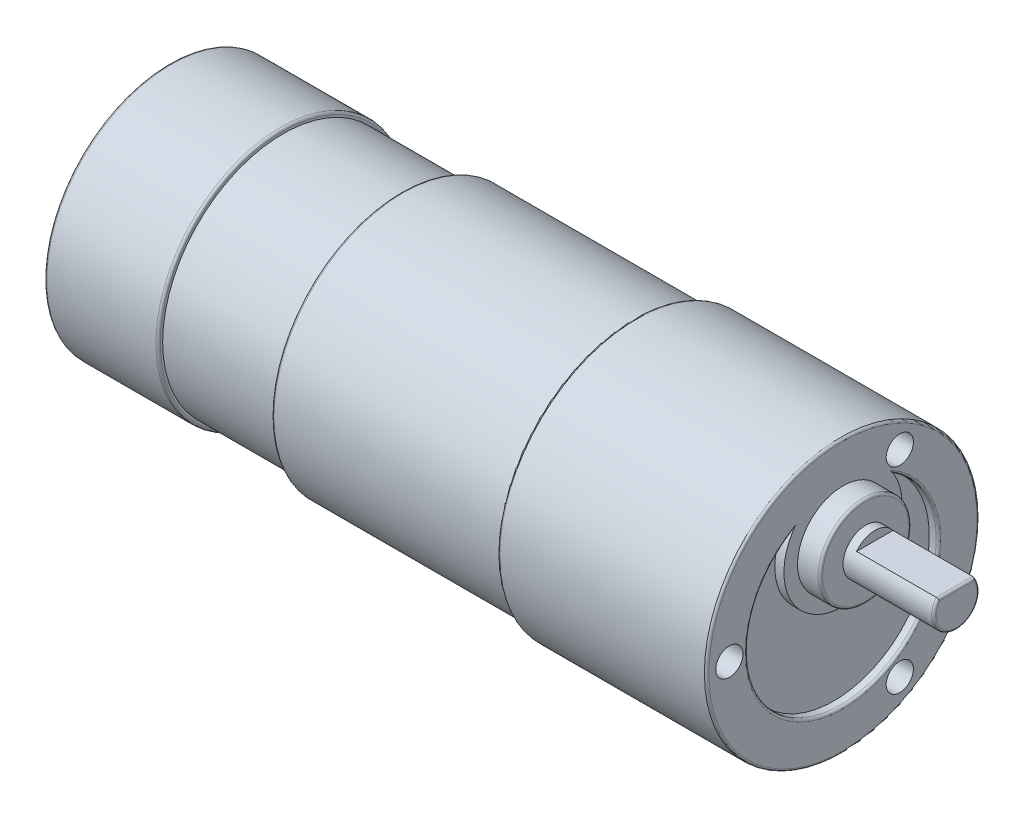
ISO-10303-21;
HEADER;
FILE_DESCRIPTION(('STEP AP214'),'2;1');
FILE_NAME('part.step','',(''),(''),'','','');
FILE_SCHEMA(('AUTOMOTIVE_DESIGN { 1 0 10303 214 1 1 1 1 }'));
ENDSEC;
DATA;
#1=APPLICATION_CONTEXT('core data for automotive mechanical design processes');
#2=APPLICATION_PROTOCOL_DEFINITION('international standard','automotive_design',2000,#1);
#3=PRODUCT_CONTEXT('',#1,'mechanical');
#4=PRODUCT('Part','Part','',(#3));
#5=PRODUCT_RELATED_PRODUCT_CATEGORY('part','',(#4));
#6=PRODUCT_DEFINITION_FORMATION('','',#4);
#7=PRODUCT_DEFINITION_CONTEXT('part definition',#1,'design');
#8=PRODUCT_DEFINITION('design','',#6,#7);
#9=PRODUCT_DEFINITION_SHAPE('','',#8);
#10=(LENGTH_UNIT() NAMED_UNIT(*) SI_UNIT(.MILLI.,.METRE.));
#11=(NAMED_UNIT(*) PLANE_ANGLE_UNIT() SI_UNIT($,.RADIAN.));
#12=(NAMED_UNIT(*) SI_UNIT($,.STERADIAN.) SOLID_ANGLE_UNIT());
#13=UNCERTAINTY_MEASURE_WITH_UNIT(LENGTH_MEASURE(1.E-05),#10,'distance_accuracy_value','');
#14=(GEOMETRIC_REPRESENTATION_CONTEXT(3) GLOBAL_UNCERTAINTY_ASSIGNED_CONTEXT((#13)) GLOBAL_UNIT_ASSIGNED_CONTEXT((#10,
#11,#12)) REPRESENTATION_CONTEXT('',''));
#15=CARTESIAN_POINT('',(0.,0.,0.));
#16=DIRECTION('',(0.,0.,1.));
#17=DIRECTION('',(1.,0.,0.));
#18=AXIS2_PLACEMENT_3D('',#15,#16,#17);
#19=CARTESIAN_POINT('',(74.1,0.,0.));
#20=DIRECTION('',(1.,0.,0.));
#21=DIRECTION('',(0.,0.,-1.));
#22=AXIS2_PLACEMENT_3D('',#19,#20,#21);
#23=PLANE('',#22);
#24=CARTESIAN_POINT('',(74.1,0.,0.));
#25=DIRECTION('',(1.,0.,0.));
#26=DIRECTION('',(0.,0.,-1.));
#27=AXIS2_PLACEMENT_3D('',#24,#25,#26);
#28=CIRCLE('',#27,14.75);
#29=CARTESIAN_POINT('',(74.1,0.,-14.75));
#30=VERTEX_POINT('',#29);
#31=EDGE_CURVE('E191',#30,#30,#28,.T.);
#32=ORIENTED_EDGE('',*,*,#31,.T.);
#33=EDGE_LOOP('',(#32));
#34=FACE_BOUND('',#33,.T.);
#35=CARTESIAN_POINT('',(74.1,0.,12.5));
#36=DIRECTION('',(1.,0.,0.));
#37=DIRECTION('',(0.,0.,-1.));
#38=AXIS2_PLACEMENT_3D('',#35,#36,#37);
#39=CIRCLE('',#38,1.5);
#40=CARTESIAN_POINT('',(74.1,0.,11.));
#41=VERTEX_POINT('',#40);
#42=EDGE_CURVE('E285',#41,#41,#39,.T.);
#43=ORIENTED_EDGE('',*,*,#42,.F.);
#44=EDGE_LOOP('',(#43));
#45=FACE_BOUND('',#44,.T.);
#46=CARTESIAN_POINT('',(74.1,-10.8253175473055,-6.24999999999998));
#47=DIRECTION('',(1.,0.,0.));
#48=DIRECTION('',(0.,0.,-1.));
#49=AXIS2_PLACEMENT_3D('',#46,#47,#48);
#50=CIRCLE('',#49,1.5);
#51=CARTESIAN_POINT('',(74.1,-10.8253175473055,-7.74999999999998));
#52=VERTEX_POINT('',#51);
#53=EDGE_CURVE('E294',#52,#52,#50,.T.);
#54=ORIENTED_EDGE('',*,*,#53,.F.);
#55=EDGE_LOOP('',(#54));
#56=FACE_BOUND('',#55,.T.);
#57=CARTESIAN_POINT('',(74.1,10.8253175473055,-6.24999999999997));
#58=DIRECTION('',(1.,0.,0.));
#59=DIRECTION('',(0.,0.,-1.));
#60=AXIS2_PLACEMENT_3D('',#57,#58,#59);
#61=CIRCLE('',#60,1.5);
#62=CARTESIAN_POINT('',(74.1,10.8253175473055,-7.74999999999997));
#63=VERTEX_POINT('',#62);
#64=EDGE_CURVE('E300',#63,#63,#61,.T.);
#65=ORIENTED_EDGE('',*,*,#64,.F.);
#66=EDGE_LOOP('',(#65));
#67=FACE_BOUND('',#66,.T.);
#68=CARTESIAN_POINT('',(74.1,5.5,0.));
#69=DIRECTION('',(1.,0.,0.));
#70=DIRECTION('',(0.,0.,-1.));
#71=AXIS2_PLACEMENT_3D('',#68,#69,#70);
#72=CIRCLE('',#71,5.);
#73=CARTESIAN_POINT('',(74.1,5.5,-5.));
#74=VERTEX_POINT('',#73);
#75=EDGE_CURVE('E115',#74,#74,#72,.T.);
#76=ORIENTED_EDGE('',*,*,#75,.F.);
#77=EDGE_LOOP('',(#76));
#78=FACE_BOUND('',#77,.T.);
#79=CARTESIAN_POINT('',(74.1,5.5,0.));
#80=DIRECTION('',(1.,0.,0.));
#81=DIRECTION('',(0.,0.,-1.));
#82=AXIS2_PLACEMENT_3D('',#79,#80,#81);
#83=CIRCLE('',#82,6.5);
#84=CARTESIAN_POINT('',(74.1,9.41477272727273,5.18888759695194));
#85=VERTEX_POINT('',#84);
#86=CARTESIAN_POINT('',(74.1,9.41477272727273,-5.18888759695194));
#87=VERTEX_POINT('',#86);
#88=EDGE_CURVE('E107',#85,#87,#83,.T.);
#89=ORIENTED_EDGE('',*,*,#88,.T.);
#90=CARTESIAN_POINT('',(74.1,0.,0.));
#91=DIRECTION('',(1.,0.,0.));
#92=DIRECTION('',(0.,0.,-1.));
#93=AXIS2_PLACEMENT_3D('',#90,#91,#92);
#94=CIRCLE('',#93,10.75);
#95=EDGE_CURVE('E188',#87,#85,#94,.F.);
#96=ORIENTED_EDGE('',*,*,#95,.T.);
#97=EDGE_LOOP('',(#89,#96));
#98=FACE_BOUND('',#97,.T.);
#99=ADVANCED_FACE('F36',(#34,#45,#56,#67,#78,#98),#23,.T.);
#100=CARTESIAN_POINT('',(76.6,0.,0.));
#101=DIRECTION('',(-1.,0.,0.));
#102=DIRECTION('',(0.,0.,1.));
#103=AXIS2_PLACEMENT_3D('',#100,#101,#102);
#104=CYLINDRICAL_SURFACE('',#103,15.);
#105=CARTESIAN_POINT('',(51.35,0.,0.));
#106=DIRECTION('',(-1.,0.,0.));
#107=DIRECTION('',(0.,0.,1.));
#108=AXIS2_PLACEMENT_3D('',#105,#106,#107);
#109=CIRCLE('',#108,15.);
#110=CARTESIAN_POINT('',(51.35,0.,15.));
#111=VERTEX_POINT('',#110);
#112=EDGE_CURVE('E182',#111,#111,#109,.F.);
#113=ORIENTED_EDGE('',*,*,#112,.T.);
#114=EDGE_LOOP('',(#113));
#115=FACE_BOUND('',#114,.T.);
#116=CARTESIAN_POINT('',(73.85,0.,0.));
#117=DIRECTION('',(1.,0.,0.));
#118=DIRECTION('',(0.,0.,-1.));
#119=AXIS2_PLACEMENT_3D('',#116,#117,#118);
#120=CIRCLE('',#119,15.);
#121=CARTESIAN_POINT('',(73.85,0.,-15.));
#122=VERTEX_POINT('',#121);
#123=EDGE_CURVE('E179',#122,#122,#120,.F.);
#124=ORIENTED_EDGE('',*,*,#123,.T.);
#125=EDGE_LOOP('',(#124));
#126=FACE_BOUND('',#125,.T.);
#127=ADVANCED_FACE('F218',(#115,#126),#104,.T.);
#128=CARTESIAN_POINT('',(-4.33,0.,0.));
#129=DIRECTION('',(-1.,0.,0.));
#130=DIRECTION('',(0.,0.,1.));
#131=AXIS2_PLACEMENT_3D('',#128,#129,#130);
#132=CYLINDRICAL_SURFACE('',#131,13.75);
#133=CARTESIAN_POINT('',(12.25,0.,0.));
#134=DIRECTION('',(1.,0.,0.));
#135=DIRECTION('',(0.,0.,-1.));
#136=AXIS2_PLACEMENT_3D('',#133,#134,#135);
#137=CIRCLE('',#136,13.75);
#138=CARTESIAN_POINT('',(12.25,0.,-13.75));
#139=VERTEX_POINT('',#138);
#140=EDGE_CURVE('E162',#139,#139,#137,.F.);
#141=ORIENTED_EDGE('',*,*,#140,.T.);
#142=EDGE_LOOP('',(#141));
#143=FACE_BOUND('',#142,.T.);
#144=CARTESIAN_POINT('',(0.25,0.,0.));
#145=DIRECTION('',(1.,0.,0.));
#146=DIRECTION('',(0.,0.,-1.));
#147=AXIS2_PLACEMENT_3D('',#144,#145,#146);
#148=CIRCLE('',#147,13.75);
#149=CARTESIAN_POINT('',(0.25,0.,-13.75));
#150=VERTEX_POINT('',#149);
#151=EDGE_CURVE('E159',#150,#150,#148,.T.);
#152=ORIENTED_EDGE('',*,*,#151,.T.);
#153=EDGE_LOOP('',(#152));
#154=FACE_BOUND('',#153,.T.);
#155=ADVANCED_FACE('F239',(#143,#154),#132,.T.);
#156=CARTESIAN_POINT('',(12.5,13.75,0.));
#157=DIRECTION('',(1.,0.,0.));
#158=DIRECTION('',(0.,0.,-1.));
#159=AXIS2_PLACEMENT_3D('',#156,#157,#158);
#160=PLANE('',#159);
#161=CARTESIAN_POINT('',(12.5,0.,0.));
#162=DIRECTION('',(1.,0.,0.));
#163=DIRECTION('',(0.,0.,-1.));
#164=AXIS2_PLACEMENT_3D('',#161,#162,#163);
#165=CIRCLE('',#164,13.5);
#166=CARTESIAN_POINT('',(12.5,0.,-13.5));
#167=VERTEX_POINT('',#166);
#168=EDGE_CURVE('E166',#167,#167,#165,.T.);
#169=ORIENTED_EDGE('',*,*,#168,.T.);
#170=EDGE_LOOP('',(#169));
#171=FACE_BOUND('',#170,.T.);
#172=CARTESIAN_POINT('',(12.5,0.,0.));
#173=DIRECTION('',(-1.,0.,0.));
#174=DIRECTION('',(0.,0.,1.));
#175=AXIS2_PLACEMENT_3D('',#172,#173,#174);
#176=CIRCLE('',#175,13.25);
#177=CARTESIAN_POINT('',(12.5,0.,13.25));
#178=VERTEX_POINT('',#177);
#179=EDGE_CURVE('E125',#178,#178,#176,.T.);
#180=ORIENTED_EDGE('',*,*,#179,.T.);
#181=EDGE_LOOP('',(#180));
#182=FACE_BOUND('',#181,.T.);
#183=ADVANCED_FACE('F235',(#171,#182),#160,.T.);
#184=CARTESIAN_POINT('',(-4.33,0.,0.));
#185=DIRECTION('',(-1.,0.,0.));
#186=DIRECTION('',(0.,0.,1.));
#187=AXIS2_PLACEMENT_3D('',#184,#185,#186);
#188=CYLINDRICAL_SURFACE('',#187,13.25);
#189=CARTESIAN_POINT('',(25.5,0.,0.));
#190=DIRECTION('',(-1.,0.,0.));
#191=DIRECTION('',(0.,0.,1.));
#192=AXIS2_PLACEMENT_3D('',#189,#190,#191);
#193=CIRCLE('',#192,13.25);
#194=CARTESIAN_POINT('',(25.5,0.,13.25));
#195=VERTEX_POINT('',#194);
#196=EDGE_CURVE('E122',#195,#195,#193,.T.);
#197=ORIENTED_EDGE('',*,*,#196,.T.);
#198=EDGE_LOOP('',(#197));
#199=FACE_BOUND('',#198,.T.);
#200=ORIENTED_EDGE('',*,*,#179,.F.);
#201=EDGE_LOOP('',(#200));
#202=FACE_BOUND('',#201,.T.);
#203=ADVANCED_FACE('F231',(#199,#202),#188,.T.);
#204=CARTESIAN_POINT('',(25.5,13.25,0.));
#205=DIRECTION('',(-1.,0.,0.));
#206=DIRECTION('',(0.,0.,1.));
#207=AXIS2_PLACEMENT_3D('',#204,#205,#206);
#208=PLANE('',#207);
#209=CARTESIAN_POINT('',(25.5,0.,0.));
#210=DIRECTION('',(-1.,0.,0.));
#211=DIRECTION('',(0.,0.,1.));
#212=AXIS2_PLACEMENT_3D('',#209,#210,#211);
#213=CIRCLE('',#212,14.);
#214=CARTESIAN_POINT('',(25.5,0.,14.));
#215=VERTEX_POINT('',#214);
#216=EDGE_CURVE('E170',#215,#215,#213,.T.);
#217=ORIENTED_EDGE('',*,*,#216,.T.);
#218=EDGE_LOOP('',(#217));
#219=FACE_BOUND('',#218,.T.);
#220=ORIENTED_EDGE('',*,*,#196,.F.);
#221=EDGE_LOOP('',(#220));
#222=FACE_BOUND('',#221,.T.);
#223=ADVANCED_FACE('F227',(#219,#222),#208,.T.);
#224=CARTESIAN_POINT('',(-4.33,0.,0.));
#225=DIRECTION('',(-1.,0.,0.));
#226=DIRECTION('',(0.,0.,1.));
#227=AXIS2_PLACEMENT_3D('',#224,#225,#226);
#228=CYLINDRICAL_SURFACE('',#227,14.25);
#229=CARTESIAN_POINT('',(25.75,0.,0.));
#230=DIRECTION('',(-1.,0.,0.));
#231=DIRECTION('',(0.,0.,1.));
#232=AXIS2_PLACEMENT_3D('',#229,#230,#231);
#233=CIRCLE('',#232,14.25);
#234=CARTESIAN_POINT('',(25.75,0.,14.25));
#235=VERTEX_POINT('',#234);
#236=EDGE_CURVE('E173',#235,#235,#233,.F.);
#237=ORIENTED_EDGE('',*,*,#236,.T.);
#238=EDGE_LOOP('',(#237));
#239=FACE_BOUND('',#238,.T.);
#240=CARTESIAN_POINT('',(51.1,0.,0.));
#241=DIRECTION('',(-1.,0.,0.));
#242=DIRECTION('',(0.,0.,1.));
#243=AXIS2_PLACEMENT_3D('',#240,#241,#242);
#244=CIRCLE('',#243,14.25);
#245=CARTESIAN_POINT('',(51.1,0.,14.25));
#246=VERTEX_POINT('',#245);
#247=EDGE_CURVE('E119',#246,#246,#244,.T.);
#248=ORIENTED_EDGE('',*,*,#247,.T.);
#249=EDGE_LOOP('',(#248));
#250=FACE_BOUND('',#249,.T.);
#251=ADVANCED_FACE('F223',(#239,#250),#228,.T.);
#252=CARTESIAN_POINT('',(51.1,14.25,0.));
#253=DIRECTION('',(-1.,0.,0.));
#254=DIRECTION('',(0.,0.,1.));
#255=AXIS2_PLACEMENT_3D('',#252,#253,#254);
#256=PLANE('',#255);
#257=CARTESIAN_POINT('',(51.1,0.,0.));
#258=DIRECTION('',(-1.,0.,0.));
#259=DIRECTION('',(0.,0.,1.));
#260=AXIS2_PLACEMENT_3D('',#257,#258,#259);
#261=CIRCLE('',#260,14.75);
#262=CARTESIAN_POINT('',(51.1,0.,14.75));
#263=VERTEX_POINT('',#262);
#264=EDGE_CURVE('E176',#263,#263,#261,.T.);
#265=ORIENTED_EDGE('',*,*,#264,.T.);
#266=EDGE_LOOP('',(#265));
#267=FACE_BOUND('',#266,.T.);
#268=ORIENTED_EDGE('',*,*,#247,.F.);
#269=EDGE_LOOP('',(#268));
#270=FACE_BOUND('',#269,.T.);
#271=ADVANCED_FACE('F220',(#267,#270),#256,.T.);
#272=CARTESIAN_POINT('',(0.,0.,0.));
#273=DIRECTION('',(1.,0.,0.));
#274=DIRECTION('',(0.,0.,-1.));
#275=AXIS2_PLACEMENT_3D('',#272,#273,#274);
#276=PLANE('',#275);
#277=CARTESIAN_POINT('',(0.,0.,0.));
#278=DIRECTION('',(1.,0.,0.));
#279=DIRECTION('',(0.,0.,-1.));
#280=AXIS2_PLACEMENT_3D('',#277,#278,#279);
#281=CIRCLE('',#280,13.5);
#282=CARTESIAN_POINT('',(0.,0.,-13.5));
#283=VERTEX_POINT('',#282);
#284=EDGE_CURVE('E185',#283,#283,#281,.F.);
#285=ORIENTED_EDGE('',*,*,#284,.T.);
#286=EDGE_LOOP('',(#285));
#287=FACE_BOUND('',#286,.T.);
#288=ADVANCED_FACE('F214',(#287),#276,.F.);
#289=CARTESIAN_POINT('',(74.1,5.5,0.));
#290=DIRECTION('',(1.,0.,0.));
#291=DIRECTION('',(0.,0.,-1.));
#292=AXIS2_PLACEMENT_3D('',#289,#290,#291);
#293=CYLINDRICAL_SURFACE('',#292,5.);
#294=CARTESIAN_POINT('',(76.35,5.5,0.));
#295=DIRECTION('',(1.,0.,0.));
#296=DIRECTION('',(0.,0.,-1.));
#297=AXIS2_PLACEMENT_3D('',#294,#295,#296);
#298=CIRCLE('',#297,5.);
#299=CARTESIAN_POINT('',(76.35,5.5,-5.));
#300=VERTEX_POINT('',#299);
#301=EDGE_CURVE('E156',#300,#300,#298,.F.);
#302=ORIENTED_EDGE('',*,*,#301,.T.);
#303=EDGE_LOOP('',(#302));
#304=FACE_BOUND('',#303,.T.);
#305=ORIENTED_EDGE('',*,*,#75,.T.);
#306=EDGE_LOOP('',(#305));
#307=FACE_BOUND('',#306,.T.);
#308=ADVANCED_FACE('F209',(#304,#307),#293,.T.);
#309=CARTESIAN_POINT('',(77.6,5.5,0.));
#310=DIRECTION('',(1.,0.,0.));
#311=DIRECTION('',(0.,0.,-1.));
#312=AXIS2_PLACEMENT_3D('',#309,#310,#311);
#313=PLANE('',#312);
#314=CARTESIAN_POINT('',(77.6,5.5,0.));
#315=DIRECTION('',(1.,0.,0.));
#316=DIRECTION('',(0.,0.,-1.));
#317=AXIS2_PLACEMENT_3D('',#314,#315,#316);
#318=CIRCLE('',#317,2.5);
#319=CARTESIAN_POINT('',(77.6,7.,-2.));
#320=VERTEX_POINT('',#319);
#321=CARTESIAN_POINT('',(77.6,7.,2.));
#322=VERTEX_POINT('',#321);
#323=EDGE_CURVE('E129',#320,#322,#318,.T.);
#324=ORIENTED_EDGE('',*,*,#323,.T.);
#325=DIRECTION('',(0.,0.,-1.));
#326=VECTOR('',#325,1.);
#327=CARTESIAN_POINT('',(77.6,7.,2.));
#328=LINE('',#327,#326);
#329=EDGE_CURVE('E131',#322,#320,#328,.T.);
#330=ORIENTED_EDGE('',*,*,#329,.T.);
#331=EDGE_LOOP('',(#324,#330));
#332=FACE_BOUND('',#331,.T.);
#333=ADVANCED_FACE('F213',(#332),#313,.T.);
#334=CARTESIAN_POINT('',(77.6,7.,2.));
#335=DIRECTION('',(0.,-1.,0.));
#336=DIRECTION('',(0.,0.,-1.));
#337=AXIS2_PLACEMENT_3D('',#334,#335,#336);
#338=PLANE('',#337);
#339=DIRECTION('',(1.,0.,0.));
#340=VECTOR('',#339,1.);
#341=CARTESIAN_POINT('',(77.6,7.,2.));
#342=LINE('',#341,#340);
#343=CARTESIAN_POINT('',(86.35,7.,2.));
#344=VERTEX_POINT('',#343);
#345=EDGE_CURVE('E134',#322,#344,#342,.T.);
#346=ORIENTED_EDGE('',*,*,#345,.T.);
#347=DIRECTION('',(0.,0.,-1.));
#348=VECTOR('',#347,1.);
#349=CARTESIAN_POINT('',(86.35,7.,-2.));
#350=LINE('',#349,#348);
#351=CARTESIAN_POINT('',(86.35,7.,-2.));
#352=VERTEX_POINT('',#351);
#353=EDGE_CURVE('E143',#344,#352,#350,.T.);
#354=ORIENTED_EDGE('',*,*,#353,.T.);
#355=DIRECTION('',(1.,0.,0.));
#356=VECTOR('',#355,1.);
#357=CARTESIAN_POINT('',(77.6,7.,-2.));
#358=LINE('',#357,#356);
#359=EDGE_CURVE('E135',#320,#352,#358,.T.);
#360=ORIENTED_EDGE('',*,*,#359,.F.);
#361=ORIENTED_EDGE('',*,*,#329,.F.);
#362=EDGE_LOOP('',(#346,#354,#360,#361));
#363=FACE_BOUND('',#362,.T.);
#364=ADVANCED_FACE('F246',(#363),#338,.F.);
#365=CARTESIAN_POINT('',(86.6,5.5,0.));
#366=DIRECTION('',(1.,0.,0.));
#367=DIRECTION('',(0.,0.,-1.));
#368=AXIS2_PLACEMENT_3D('',#365,#366,#367);
#369=PLANE('',#368);
#370=CARTESIAN_POINT('',(86.6,5.5,0.));
#371=DIRECTION('',(1.,0.,0.));
#372=DIRECTION('',(0.,0.,-1.));
#373=AXIS2_PLACEMENT_3D('',#370,#371,#372);
#374=CIRCLE('',#373,2.25);
#375=CARTESIAN_POINT('',(86.6,6.74999999999992,1.87082869338702));
#376=VERTEX_POINT('',#375);
#377=CARTESIAN_POINT('',(86.6,6.74999999999992,-1.87082869338702));
#378=VERTEX_POINT('',#377);
#379=EDGE_CURVE('E146',#376,#378,#374,.T.);
#380=ORIENTED_EDGE('',*,*,#379,.T.);
#381=DIRECTION('',(0.,0.,-1.));
#382=VECTOR('',#381,1.);
#383=CARTESIAN_POINT('',(86.6,6.75,2.));
#384=LINE('',#383,#382);
#385=EDGE_CURVE('E148',#378,#376,#384,.F.);
#386=ORIENTED_EDGE('',*,*,#385,.T.);
#387=EDGE_LOOP('',(#380,#386));
#388=FACE_BOUND('',#387,.T.);
#389=ADVANCED_FACE('F250',(#388),#369,.T.);
#390=CARTESIAN_POINT('',(86.6,5.5,0.));
#391=DIRECTION('',(-1.,0.,0.));
#392=DIRECTION('',(0.,0.,1.));
#393=AXIS2_PLACEMENT_3D('',#390,#391,#392);
#394=CYLINDRICAL_SURFACE('',#393,2.5);
#395=ORIENTED_EDGE('',*,*,#359,.T.);
#396=CARTESIAN_POINT('',(86.35,5.5,0.));
#397=DIRECTION('',(1.,0.,0.));
#398=DIRECTION('',(0.,0.,-1.));
#399=AXIS2_PLACEMENT_3D('',#396,#397,#398);
#400=CIRCLE('',#399,2.5);
#401=EDGE_CURVE('E151',#352,#344,#400,.F.);
#402=ORIENTED_EDGE('',*,*,#401,.T.);
#403=ORIENTED_EDGE('',*,*,#345,.F.);
#404=ORIENTED_EDGE('',*,*,#323,.F.);
#405=EDGE_LOOP('',(#395,#402,#403,#404));
#406=FACE_BOUND('',#405,.T.);
#407=CARTESIAN_POINT('',(76.6,5.5,0.));
#408=DIRECTION('',(1.,0.,0.));
#409=DIRECTION('',(0.,0.,-1.));
#410=AXIS2_PLACEMENT_3D('',#407,#408,#409);
#411=CIRCLE('',#410,2.5);
#412=CARTESIAN_POINT('',(76.6,5.5,-2.5));
#413=VERTEX_POINT('',#412);
#414=EDGE_CURVE('E138',#413,#413,#411,.T.);
#415=ORIENTED_EDGE('',*,*,#414,.T.);
#416=EDGE_LOOP('',(#415));
#417=FACE_BOUND('',#416,.T.);
#418=ADVANCED_FACE('F254',(#406,#417),#394,.T.);
#419=CARTESIAN_POINT('',(76.6,0.,0.));
#420=DIRECTION('',(1.,0.,0.));
#421=DIRECTION('',(0.,0.,-1.));
#422=AXIS2_PLACEMENT_3D('',#419,#420,#421);
#423=PLANE('',#422);
#424=CARTESIAN_POINT('',(76.6,5.5,0.));
#425=DIRECTION('',(1.,0.,0.));
#426=DIRECTION('',(0.,0.,-1.));
#427=AXIS2_PLACEMENT_3D('',#424,#425,#426);
#428=CIRCLE('',#427,4.75);
#429=CARTESIAN_POINT('',(76.6,5.5,-4.75));
#430=VERTEX_POINT('',#429);
#431=EDGE_CURVE('E153',#430,#430,#428,.T.);
#432=ORIENTED_EDGE('',*,*,#431,.T.);
#433=EDGE_LOOP('',(#432));
#434=FACE_BOUND('',#433,.T.);
#435=ORIENTED_EDGE('',*,*,#414,.F.);
#436=EDGE_LOOP('',(#435));
#437=FACE_BOUND('',#436,.T.);
#438=ADVANCED_FACE('F207',(#434,#437),#423,.T.);
#439=CARTESIAN_POINT('',(73.1,5.5,0.));
#440=DIRECTION('',(1.,0.,0.));
#441=DIRECTION('',(0.,0.,-1.));
#442=AXIS2_PLACEMENT_3D('',#439,#440,#441);
#443=CYLINDRICAL_SURFACE('',#442,6.5);
#444=ORIENTED_EDGE('',*,*,#88,.F.);
#445=CARTESIAN_POINT('',(74.1,9.41477272727273,5.18888759695194));
#446=CARTESIAN_POINT('',(74.0999831649846,9.39188239122904,5.20615884082959));
#447=CARTESIAN_POINT('',(74.0991753234182,9.36886658255452,5.22328398875272));
#448=CARTESIAN_POINT('',(74.0957931354124,9.3226129209461,5.25722854772138));
#449=CARTESIAN_POINT('',(74.0932123987342,9.29937456562936,5.27404662610108));
#450=CARTESIAN_POINT('',(74.0861164066224,9.25299622371637,5.3071487445332));
#451=CARTESIAN_POINT('',(74.0816115410013,9.2298563734107,5.3234351542232));
#452=CARTESIAN_POINT('',(74.0703431126138,9.18376488104019,5.35543275883427));
#453=CARTESIAN_POINT('',(74.0635833442933,9.16081298872184,5.37114487120059));
#454=CARTESIAN_POINT('',(74.0505738368938,9.12464922044669,5.39557066729247));
#455=CARTESIAN_POINT('',(74.0452363549753,9.11127527741722,5.40452991113922));
#456=CARTESIAN_POINT('',(74.0333522593504,9.08475501451608,5.42215693384593));
#457=CARTESIAN_POINT('',(74.0267996367027,9.07161019745475,5.43082299943601));
#458=CARTESIAN_POINT('',(74.0100937271802,9.04198319364183,5.4502068165354));
#459=CARTESIAN_POINT('',(73.9994491725242,9.02567126336535,5.46076813371098));
#460=CARTESIAN_POINT('',(73.9749067539139,8.99480513941149,5.48057142003858));
#461=CARTESIAN_POINT('',(73.9610379237557,8.9802369205262,5.4898240431316));
#462=CARTESIAN_POINT('',(73.9390596873975,8.96299069281043,5.50070244888107));
#463=CARTESIAN_POINT('',(73.9328544347275,8.95861949916991,5.50345109614572));
#464=CARTESIAN_POINT('',(73.919790137191,8.95061304835876,5.50847451220193));
#465=CARTESIAN_POINT('',(73.9129306928377,8.94697824515758,5.51074898870195));
#466=CARTESIAN_POINT('',(73.8984844869997,8.94066519711013,5.51469285374608));
#467=CARTESIAN_POINT('',(73.8908887089306,8.9380014115633,5.51635310089658));
#468=CARTESIAN_POINT('',(73.875230242602,8.93401862802945,5.51883337619474));
#469=CARTESIAN_POINT('',(73.8671696716696,8.93269397335876,5.5196569386938));
#470=CARTESIAN_POINT('',(73.8575477575341,8.93202684836659,5.52007171065));
#471=CARTESIAN_POINT('',(73.8560393566279,8.93194865450147,5.52012032670253));
#472=CARTESIAN_POINT('',(73.8530208395366,8.93184443409094,5.52018512365069));
#473=CARTESIAN_POINT('',(73.8515107246499,8.93181838046335,5.52020132138473));
#474=CARTESIAN_POINT('',(73.85,8.93181818181818,5.52020144260535));
#475=B_SPLINE_CURVE_WITH_KNOTS('',3,(#445,#446,#447,#448,#449,#450,#451,#452,#453,#454,#455,
#456,#457,#458,#459,#460,#461,#462,#463,#464,#465,#466,#467,#468,#469,#470,#471,#472,#473,#474),
.UNSPECIFIED.,.F.,.F.,(4,2,2,2,2,2,2,2,2,2,2,2,2,2,4),(0.,0.086033021068687,0.172377778646507,
0.258262076114619,0.34400257444526,0.394845140897501,0.445946176578029,0.512246641303248,
0.577971751342751,0.60213310887671,0.626309316363986,0.650832092329457,0.675250842150749,
0.679783842547829,0.684314487845205),.UNSPECIFIED.);
#476=CARTESIAN_POINT('',(73.85,8.93181818181818,5.52020144260535));
#477=VERTEX_POINT('',#476);
#478=EDGE_CURVE('E11',#85,#477,#475,.T.);
#479=ORIENTED_EDGE('',*,*,#478,.T.);
#480=DIRECTION('',(1.,0.,0.));
#481=VECTOR('',#480,1.);
#482=CARTESIAN_POINT('',(73.1,8.93181818181818,5.52020144260535));
#483=LINE('',#482,#481);
#484=CARTESIAN_POINT('',(73.1,8.93181818181818,5.52020144260535));
#485=VERTEX_POINT('',#484);
#486=EDGE_CURVE('E93',#485,#477,#483,.T.);
#487=ORIENTED_EDGE('',*,*,#486,.F.);
#488=CARTESIAN_POINT('',(73.1,5.5,0.));
#489=DIRECTION('',(1.,0.,0.));
#490=DIRECTION('',(0.,0.,-1.));
#491=AXIS2_PLACEMENT_3D('',#488,#489,#490);
#492=CIRCLE('',#491,6.5);
#493=CARTESIAN_POINT('',(73.1,8.93181818181818,-5.52020144260535));
#494=VERTEX_POINT('',#493);
#495=EDGE_CURVE('E97',#485,#494,#492,.T.);
#496=ORIENTED_EDGE('',*,*,#495,.T.);
#497=DIRECTION('',(1.,0.,0.));
#498=VECTOR('',#497,1.);
#499=CARTESIAN_POINT('',(73.1,8.93181818181818,-5.52020144260535));
#500=LINE('',#499,#498);
#501=CARTESIAN_POINT('',(73.85,8.93181818181818,-5.52020144260535));
#502=VERTEX_POINT('',#501);
#503=EDGE_CURVE('E101',#494,#502,#500,.T.);
#504=ORIENTED_EDGE('',*,*,#503,.T.);
#505=CARTESIAN_POINT('',(73.85,8.93181818181818,-5.52020144260535));
#506=CARTESIAN_POINT('',(73.8568371419132,8.93180281094858,-5.52021065025864));
#507=CARTESIAN_POINT('',(73.8636509768345,8.93235286954474,-5.51986905081773));
#508=CARTESIAN_POINT('',(73.876989340396,8.93444190697464,-5.51856967414837));
#509=CARTESIAN_POINT('',(73.8835162568305,8.93596972410108,-5.51761885142953));
#510=CARTESIAN_POINT('',(73.8977122879727,8.94034426729592,-5.51489246680858));
#511=CARTESIAN_POINT('',(73.9052822443313,8.94341873928312,-5.51297423179716));
#512=CARTESIAN_POINT('',(73.9197603296231,8.95056087529103,-5.50850684291174));
#513=CARTESIAN_POINT('',(73.9266652003571,8.95463311359151,-5.50595478249582));
#514=CARTESIAN_POINT('',(73.9436441527478,8.96608952093307,-5.4987536130998));
#515=CARTESIAN_POINT('',(73.9531990477944,8.97401453429378,-5.49375295379665));
#516=CARTESIAN_POINT('',(73.9708239918423,8.99092131612563,-5.48302565409446));
#517=CARTESIAN_POINT('',(73.9788911113355,8.99990511360151,-5.47729761810294));
#518=CARTESIAN_POINT('',(74.0009226539621,9.02736326340329,-5.4596857108105));
#519=CARTESIAN_POINT('',(74.0132029619165,9.04674096011591,-5.44712634608222));
#520=CARTESIAN_POINT('',(74.0346159086907,9.08660356892157,-5.42096437681789));
#521=CARTESIAN_POINT('',(74.043726376092,9.10709516473281,-5.40735520656361));
#522=CARTESIAN_POINT('',(74.0607250616321,9.15178411402678,-5.37729528535604));
#523=CARTESIAN_POINT('',(74.0682011480643,9.17606104847757,-5.36073235371579));
#524=CARTESIAN_POINT('',(74.0805871535669,9.22485399697535,-5.32694543446326));
#525=CARTESIAN_POINT('',(74.0854919304833,9.24937039097393,-5.30972019559369));
#526=CARTESIAN_POINT('',(74.0929885834177,9.29751029419979,-5.27539166677475));
#527=CARTESIAN_POINT('',(74.095656243952,9.32113466528149,-5.25830567614696));
#528=CARTESIAN_POINT('',(74.0991490837716,9.36813965922631,-5.22382484869674));
#529=CARTESIAN_POINT('',(74.099982149429,9.39152089368149,-5.2064316590972));
#530=CARTESIAN_POINT('',(74.1,9.41477272727273,-5.18888759695194));
#531=B_SPLINE_CURVE_WITH_KNOTS('',3,(#505,#506,#507,#508,#509,#510,#511,#512,#513,#514,#515,
#516,#517,#518,#519,#520,#521,#522,#523,#524,#525,#526,#527,#528,#529,#530),.UNSPECIFIED.,.F.,
.F.,(4,2,2,2,2,2,2,2,2,2,2,2,4),(0.,0.0204431686751535,0.0406570308188243,0.0656950451517033,
0.0908500681074269,0.130772663874315,0.170773049049668,0.248799144665643,0.327360511106286,
0.418172588881486,0.509165588209976,0.596934921785879,0.684326218799791),.UNSPECIFIED.);
#532=EDGE_CURVE('E51',#502,#87,#531,.T.);
#533=ORIENTED_EDGE('',*,*,#532,.T.);
#534=EDGE_LOOP('',(#444,#479,#487,#496,#504,#533));
#535=FACE_BOUND('',#534,.T.);
#536=ADVANCED_FACE('F95',(#535),#443,.T.);
#537=CARTESIAN_POINT('',(73.1,0.,0.));
#538=DIRECTION('',(1.,0.,0.));
#539=DIRECTION('',(0.,0.,-1.));
#540=AXIS2_PLACEMENT_3D('',#537,#538,#539);
#541=CYLINDRICAL_SURFACE('',#540,10.5);
#542=ORIENTED_EDGE('',*,*,#486,.T.);
#543=CARTESIAN_POINT('',(73.85,0.,0.));
#544=DIRECTION('',(1.,0.,0.));
#545=DIRECTION('',(0.,0.,-1.));
#546=AXIS2_PLACEMENT_3D('',#543,#544,#545);
#547=CIRCLE('',#546,10.5);
#548=EDGE_CURVE('E194',#477,#502,#547,.T.);
#549=ORIENTED_EDGE('',*,*,#548,.T.);
#550=ORIENTED_EDGE('',*,*,#503,.F.);
#551=CARTESIAN_POINT('',(73.1,0.,0.));
#552=DIRECTION('',(1.,0.,0.));
#553=DIRECTION('',(0.,0.,-1.));
#554=AXIS2_PLACEMENT_3D('',#551,#552,#553);
#555=CIRCLE('',#554,10.5);
#556=EDGE_CURVE('E102',#485,#494,#555,.T.);
#557=ORIENTED_EDGE('',*,*,#556,.F.);
#558=EDGE_LOOP('',(#542,#549,#550,#557));
#559=FACE_BOUND('',#558,.T.);
#560=ADVANCED_FACE('F109',(#559),#541,.F.);
#561=CARTESIAN_POINT('',(73.1,0.,-33.1414213562373));
#562=DIRECTION('',(1.,0.,0.));
#563=DIRECTION('',(0.,0.,-1.));
#564=AXIS2_PLACEMENT_3D('',#561,#562,#563);
#565=PLANE('',#564);
#566=ORIENTED_EDGE('',*,*,#495,.F.);
#567=ORIENTED_EDGE('',*,*,#556,.T.);
#568=EDGE_LOOP('',(#566,#567));
#569=FACE_BOUND('',#568,.T.);
#570=ADVANCED_FACE('F106',(#569),#565,.T.);
#571=CARTESIAN_POINT('',(70.1,10.8253175473055,-6.24999999999997));
#572=DIRECTION('',(1.,0.,0.));
#573=DIRECTION('',(0.,0.,-1.));
#574=AXIS2_PLACEMENT_3D('',#571,#572,#573);
#575=CYLINDRICAL_SURFACE('',#574,1.5);
#576=CARTESIAN_POINT('',(70.1,10.8253175473055,-6.24999999999997));
#577=DIRECTION('',(1.,0.,0.));
#578=DIRECTION('',(0.,0.,-1.));
#579=AXIS2_PLACEMENT_3D('',#576,#577,#578);
#580=CIRCLE('',#579,1.5);
#581=CARTESIAN_POINT('',(70.1,10.8253175473055,-7.74999999999997));
#582=VERTEX_POINT('',#581);
#583=EDGE_CURVE('E114',#582,#582,#580,.T.);
#584=ORIENTED_EDGE('',*,*,#583,.F.);
#585=EDGE_LOOP('',(#584));
#586=FACE_BOUND('',#585,.T.);
#587=ORIENTED_EDGE('',*,*,#64,.T.);
#588=EDGE_LOOP('',(#587));
#589=FACE_BOUND('',#588,.T.);
#590=ADVANCED_FACE('F307',(#586,#589),#575,.F.);
#591=CARTESIAN_POINT('',(70.1,10.8253175473055,-6.24999999999997));
#592=DIRECTION('',(1.,0.,0.));
#593=DIRECTION('',(0.,0.,-1.));
#594=AXIS2_PLACEMENT_3D('',#591,#592,#593);
#595=PLANE('',#594);
#596=ORIENTED_EDGE('',*,*,#583,.T.);
#597=EDGE_LOOP('',(#596));
#598=FACE_BOUND('',#597,.T.);
#599=ADVANCED_FACE('F390',(#598),#595,.T.);
#600=CARTESIAN_POINT('',(70.1,-10.8253175473055,-6.24999999999998));
#601=DIRECTION('',(1.,0.,0.));
#602=DIRECTION('',(0.,0.,-1.));
#603=AXIS2_PLACEMENT_3D('',#600,#601,#602);
#604=CYLINDRICAL_SURFACE('',#603,1.5);
#605=CARTESIAN_POINT('',(70.1,-10.8253175473055,-6.24999999999998));
#606=DIRECTION('',(1.,0.,0.));
#607=DIRECTION('',(0.,0.,-1.));
#608=AXIS2_PLACEMENT_3D('',#605,#606,#607);
#609=CIRCLE('',#608,1.5);
#610=CARTESIAN_POINT('',(70.1,-10.8253175473055,-7.74999999999998));
#611=VERTEX_POINT('',#610);
#612=EDGE_CURVE('E297',#611,#611,#609,.T.);
#613=ORIENTED_EDGE('',*,*,#612,.F.);
#614=EDGE_LOOP('',(#613));
#615=FACE_BOUND('',#614,.T.);
#616=ORIENTED_EDGE('',*,*,#53,.T.);
#617=EDGE_LOOP('',(#616));
#618=FACE_BOUND('',#617,.T.);
#619=ADVANCED_FACE('F382',(#615,#618),#604,.F.);
#620=CARTESIAN_POINT('',(70.1,-10.8253175473055,-6.24999999999998));
#621=DIRECTION('',(1.,0.,0.));
#622=DIRECTION('',(0.,0.,-1.));
#623=AXIS2_PLACEMENT_3D('',#620,#621,#622);
#624=PLANE('',#623);
#625=ORIENTED_EDGE('',*,*,#612,.T.);
#626=EDGE_LOOP('',(#625));
#627=FACE_BOUND('',#626,.T.);
#628=ADVANCED_FACE('F373',(#627),#624,.T.);
#629=CARTESIAN_POINT('',(70.1,0.,12.5));
#630=DIRECTION('',(1.,0.,0.));
#631=DIRECTION('',(0.,0.,-1.));
#632=AXIS2_PLACEMENT_3D('',#629,#630,#631);
#633=CYLINDRICAL_SURFACE('',#632,1.5);
#634=CARTESIAN_POINT('',(70.1,0.,12.5));
#635=DIRECTION('',(1.,0.,0.));
#636=DIRECTION('',(0.,0.,-1.));
#637=AXIS2_PLACEMENT_3D('',#634,#635,#636);
#638=CIRCLE('',#637,1.5);
#639=CARTESIAN_POINT('',(70.1,0.,11.));
#640=VERTEX_POINT('',#639);
#641=EDGE_CURVE('E289',#640,#640,#638,.T.);
#642=ORIENTED_EDGE('',*,*,#641,.F.);
#643=EDGE_LOOP('',(#642));
#644=FACE_BOUND('',#643,.T.);
#645=ORIENTED_EDGE('',*,*,#42,.T.);
#646=EDGE_LOOP('',(#645));
#647=FACE_BOUND('',#646,.T.);
#648=ADVANCED_FACE('F363',(#644,#647),#633,.F.);
#649=CARTESIAN_POINT('',(70.1,0.,12.5));
#650=DIRECTION('',(1.,0.,0.));
#651=DIRECTION('',(0.,0.,-1.));
#652=AXIS2_PLACEMENT_3D('',#649,#650,#651);
#653=PLANE('',#652);
#654=ORIENTED_EDGE('',*,*,#641,.T.);
#655=EDGE_LOOP('',(#654));
#656=FACE_BOUND('',#655,.T.);
#657=ADVANCED_FACE('F271',(#656),#653,.T.);
#658=CARTESIAN_POINT('',(86.35,5.5,0.));
#659=DIRECTION('',(1.,0.,0.));
#660=DIRECTION('',(0.,0.,-1.));
#661=AXIS2_PLACEMENT_3D('',#658,#659,#660);
#662=TOROIDAL_SURFACE('',#661,2.25,0.25);
#663=CARTESIAN_POINT('',(86.35,7.,-2.));
#664=CARTESIAN_POINT('',(86.3629858188478,7.00001588317613,-2.00000720642817));
#665=CARTESIAN_POINT('',(86.3759599401248,6.99898932937452,-1.99949466157232));
#666=CARTESIAN_POINT('',(86.4014788960029,6.99497751569784,-1.99748762295127));
#667=CARTESIAN_POINT('',(86.4140250699933,6.99199909959672,-1.99599656011765));
#668=CARTESIAN_POINT('',(86.4383715392395,6.98421017461929,-1.99209033676991));
#669=CARTESIAN_POINT('',(86.4501722172479,6.97940061494954,-1.98967565502744));
#670=CARTESIAN_POINT('',(86.4727554795926,6.9681518869982,-1.98401406728345));
#671=CARTESIAN_POINT('',(86.4835374792155,6.96171179051115,-1.98076668724349));
#672=CARTESIAN_POINT('',(86.5042706530644,6.94714849754343,-1.97340088241493));
#673=CARTESIAN_POINT('',(86.5141706579347,6.93896781095042,-1.96925256549488));
#674=CARTESIAN_POINT('',(86.5324600474703,6.92137529520164,-1.96029860793866));
#675=CARTESIAN_POINT('',(86.5408489885841,6.9119631059508,-1.95549277502399));
#676=CARTESIAN_POINT('',(86.5567699291951,6.89118824542553,-1.9448412686013));
#677=CARTESIAN_POINT('',(86.5641326171242,6.87972465525421,-1.93893967786406));
#678=CARTESIAN_POINT('',(86.5768333989485,6.85596364076082,-1.92664607128975));
#679=CARTESIAN_POINT('',(86.5821700221554,6.84366561834105,-1.92025370323619));
#680=CARTESIAN_POINT('',(86.5908250259605,6.81843219632301,-1.90706797943978));
#681=CARTESIAN_POINT('',(86.5941243102735,6.80549195886683,-1.90027146539203));
#682=CARTESIAN_POINT('',(86.5986199020839,6.77937937040617,-1.8864798226521));
#683=CARTESIAN_POINT('',(86.5998202657655,6.76620751689498,-1.87948510364914));
#684=CARTESIAN_POINT('',(86.5999937753352,6.752039005063,-1.87191835122826));
#685=CARTESIAN_POINT('',(86.6000000119549,6.7510193978127,-1.87137358658556));
#686=CARTESIAN_POINT('',(86.6,6.75,-1.87082869338697));
#687=B_SPLINE_CURVE_WITH_KNOTS('',3,(#663,#664,#665,#666,#667,#668,#669,#670,#671,#672,#673,
#674,#675,#676,#677,#678,#679,#680,#681,#682,#683,#684,#685,#686),.UNSPECIFIED.,.F.,.F.,(4,2,2,
2,2,2,2,2,2,2,2,4),(0.,0.0388885936725162,0.0776415574225014,0.116374460159236,
0.155129461903457,0.195450303725417,0.235782961940748,0.280144556295894,0.324538290740358,
0.36934205751793,0.414059144501249,0.417527156387698),.UNSPECIFIED.);
#688=EDGE_CURVE('E276',#378,#352,#687,.F.);
#689=ORIENTED_EDGE('',*,*,#688,.F.);
#690=ORIENTED_EDGE('',*,*,#379,.F.);
#691=CARTESIAN_POINT('',(86.35,7.,2.));
#692=CARTESIAN_POINT('',(86.3629858188478,7.00001588317613,2.00000720642817));
#693=CARTESIAN_POINT('',(86.3759599401248,6.99898932937452,1.99949466157232));
#694=CARTESIAN_POINT('',(86.4014788960029,6.99497751569784,1.99748762295127));
#695=CARTESIAN_POINT('',(86.4140250699933,6.99199909959672,1.99599656011765));
#696=CARTESIAN_POINT('',(86.4383715392395,6.98421017461929,1.99209033676991));
#697=CARTESIAN_POINT('',(86.4501722172479,6.97940061494954,1.98967565502744));
#698=CARTESIAN_POINT('',(86.4727554795926,6.9681518869982,1.98401406728345));
#699=CARTESIAN_POINT('',(86.4835374792155,6.96171179051115,1.98076668724349));
#700=CARTESIAN_POINT('',(86.5042706530644,6.94714849754343,1.97340088241493));
#701=CARTESIAN_POINT('',(86.5141706579347,6.93896781095042,1.96925256549488));
#702=CARTESIAN_POINT('',(86.5324600474703,6.92137529520164,1.96029860793866));
#703=CARTESIAN_POINT('',(86.5408489885841,6.9119631059508,1.95549277502399));
#704=CARTESIAN_POINT('',(86.5567699291951,6.89118824542553,1.9448412686013));
#705=CARTESIAN_POINT('',(86.5641326171242,6.87972465525421,1.93893967786406));
#706=CARTESIAN_POINT('',(86.5768333989485,6.85596364076082,1.92664607128975));
#707=CARTESIAN_POINT('',(86.5821700221554,6.84366561834105,1.92025370323619));
#708=CARTESIAN_POINT('',(86.5908250259605,6.81843219632301,1.90706797943978));
#709=CARTESIAN_POINT('',(86.5941243102735,6.80549195886683,1.90027146539203));
#710=CARTESIAN_POINT('',(86.5986199020839,6.77937937040617,1.8864798226521));
#711=CARTESIAN_POINT('',(86.5998202657655,6.76620751689498,1.87948510364914));
#712=CARTESIAN_POINT('',(86.5999937753352,6.752039005063,1.87191835122826));
#713=CARTESIAN_POINT('',(86.6000000119549,6.7510193978127,1.87137358658556));
#714=CARTESIAN_POINT('',(86.6,6.75,1.87082869338697));
#715=B_SPLINE_CURVE_WITH_KNOTS('',3,(#691,#692,#693,#694,#695,#696,#697,#698,#699,#700,#701,
#702,#703,#704,#705,#706,#707,#708,#709,#710,#711,#712,#713,#714),.UNSPECIFIED.,.F.,.F.,(4,2,2,
2,2,2,2,2,2,2,2,4),(0.,0.0388885936725162,0.0776415574225014,0.116374460159236,
0.155129461903457,0.195450303725417,0.235782961940748,0.280144556295894,0.324538290740358,
0.36934205751793,0.414059144501249,0.417527156387698),.UNSPECIFIED.);
#716=EDGE_CURVE('E41',#344,#376,#715,.T.);
#717=ORIENTED_EDGE('',*,*,#716,.F.);
#718=ORIENTED_EDGE('',*,*,#401,.F.);
#719=EDGE_LOOP('',(#689,#690,#717,#718));
#720=FACE_BOUND('',#719,.T.);
#721=ADVANCED_FACE('F267',(#720),#662,.T.);
#722=CARTESIAN_POINT('',(86.35,6.75,2.));
#723=DIRECTION('',(0.,0.,1.));
#724=DIRECTION('',(1.,0.,0.));
#725=AXIS2_PLACEMENT_3D('',#722,#723,#724);
#726=CYLINDRICAL_SURFACE('',#725,0.25);
#727=ORIENTED_EDGE('',*,*,#716,.T.);
#728=ORIENTED_EDGE('',*,*,#385,.F.);
#729=ORIENTED_EDGE('',*,*,#688,.T.);
#730=ORIENTED_EDGE('',*,*,#353,.F.);
#731=EDGE_LOOP('',(#727,#728,#729,#730));
#732=FACE_BOUND('',#731,.T.);
#733=ADVANCED_FACE('F270',(#732),#726,.T.);
#734=CARTESIAN_POINT('',(76.35,5.5,0.));
#735=DIRECTION('',(1.,0.,0.));
#736=DIRECTION('',(0.,0.,-1.));
#737=AXIS2_PLACEMENT_3D('',#734,#735,#736);
#738=TOROIDAL_SURFACE('',#737,4.75,0.25);
#739=ORIENTED_EDGE('',*,*,#301,.F.);
#740=EDGE_LOOP('',(#739));
#741=FACE_BOUND('',#740,.T.);
#742=ORIENTED_EDGE('',*,*,#431,.F.);
#743=EDGE_LOOP('',(#742));
#744=FACE_BOUND('',#743,.T.);
#745=ADVANCED_FACE('F337',(#741,#744),#738,.T.);
#746=CARTESIAN_POINT('',(12.25,0.,0.));
#747=DIRECTION('',(1.,0.,0.));
#748=DIRECTION('',(0.,0.,-1.));
#749=AXIS2_PLACEMENT_3D('',#746,#747,#748);
#750=TOROIDAL_SURFACE('',#749,13.5,0.25);
#751=ORIENTED_EDGE('',*,*,#168,.F.);
#752=EDGE_LOOP('',(#751));
#753=FACE_BOUND('',#752,.T.);
#754=ORIENTED_EDGE('',*,*,#140,.F.);
#755=EDGE_LOOP('',(#754));
#756=FACE_BOUND('',#755,.T.);
#757=ADVANCED_FACE('F334',(#753,#756),#750,.T.);
#758=CARTESIAN_POINT('',(25.75,0.,0.));
#759=DIRECTION('',(-1.,0.,0.));
#760=DIRECTION('',(0.,0.,1.));
#761=AXIS2_PLACEMENT_3D('',#758,#759,#760);
#762=TOROIDAL_SURFACE('',#761,14.,0.25);
#763=ORIENTED_EDGE('',*,*,#236,.F.);
#764=EDGE_LOOP('',(#763));
#765=FACE_BOUND('',#764,.T.);
#766=ORIENTED_EDGE('',*,*,#216,.F.);
#767=EDGE_LOOP('',(#766));
#768=FACE_BOUND('',#767,.T.);
#769=ADVANCED_FACE('F330',(#765,#768),#762,.T.);
#770=CARTESIAN_POINT('',(51.35,0.,0.));
#771=DIRECTION('',(-1.,0.,0.));
#772=DIRECTION('',(0.,0.,1.));
#773=AXIS2_PLACEMENT_3D('',#770,#771,#772);
#774=TOROIDAL_SURFACE('',#773,14.75,0.25);
#775=ORIENTED_EDGE('',*,*,#112,.F.);
#776=EDGE_LOOP('',(#775));
#777=FACE_BOUND('',#776,.T.);
#778=ORIENTED_EDGE('',*,*,#264,.F.);
#779=EDGE_LOOP('',(#778));
#780=FACE_BOUND('',#779,.T.);
#781=ADVANCED_FACE('F322',(#777,#780),#774,.T.);
#782=CARTESIAN_POINT('',(0.25,0.,0.));
#783=DIRECTION('',(1.,0.,0.));
#784=DIRECTION('',(0.,0.,-1.));
#785=AXIS2_PLACEMENT_3D('',#782,#783,#784);
#786=TOROIDAL_SURFACE('',#785,13.5,0.25);
#787=ORIENTED_EDGE('',*,*,#151,.F.);
#788=EDGE_LOOP('',(#787));
#789=FACE_BOUND('',#788,.T.);
#790=ORIENTED_EDGE('',*,*,#284,.F.);
#791=EDGE_LOOP('',(#790));
#792=FACE_BOUND('',#791,.T.);
#793=ADVANCED_FACE('F317',(#789,#792),#786,.T.);
#794=CARTESIAN_POINT('',(73.85,0.,0.));
#795=DIRECTION('',(1.,0.,0.));
#796=DIRECTION('',(0.,0.,-1.));
#797=AXIS2_PLACEMENT_3D('',#794,#795,#796);
#798=TOROIDAL_SURFACE('',#797,14.75,0.25);
#799=ORIENTED_EDGE('',*,*,#123,.F.);
#800=EDGE_LOOP('',(#799));
#801=FACE_BOUND('',#800,.T.);
#802=ORIENTED_EDGE('',*,*,#31,.F.);
#803=EDGE_LOOP('',(#802));
#804=FACE_BOUND('',#803,.T.);
#805=ADVANCED_FACE('F313',(#801,#804),#798,.T.);
#806=CARTESIAN_POINT('',(73.85,0.,0.));
#807=DIRECTION('',(1.,0.,0.));
#808=DIRECTION('',(0.,0.,-1.));
#809=AXIS2_PLACEMENT_3D('',#806,#807,#808);
#810=TOROIDAL_SURFACE('',#809,10.75,0.25);
#811=ORIENTED_EDGE('',*,*,#478,.F.);
#812=ORIENTED_EDGE('',*,*,#95,.F.);
#813=ORIENTED_EDGE('',*,*,#532,.F.);
#814=ORIENTED_EDGE('',*,*,#548,.F.);
#815=EDGE_LOOP('',(#811,#812,#813,#814));
#816=FACE_BOUND('',#815,.T.);
#817=ADVANCED_FACE('F38',(#816),#810,.T.);
#818=CLOSED_SHELL('',(#99,#127,#155,#183,#203,#223,#251,#271,#288,#308,#333,#364,#389,#418,#438,
#536,#560,#570,#590,#599,#619,#628,#648,#657,#721,#733,#745,#757,#769,#781,#793,#805,#817));
#819=MANIFOLD_SOLID_BREP('B2',#818);
#820=ADVANCED_BREP_SHAPE_REPRESENTATION('',(#18,#819),#14);
#821=SHAPE_DEFINITION_REPRESENTATION(#9,#820);
ENDSEC;
END-ISO-10303-21;
